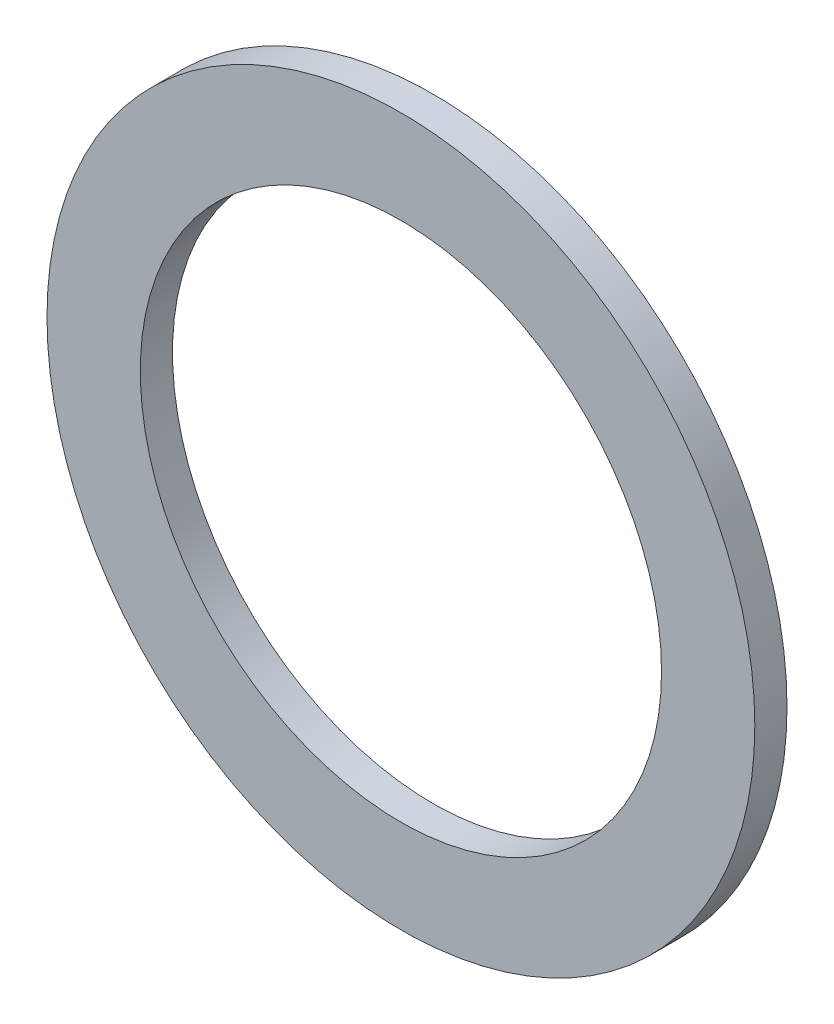
ISO-10303-21;
HEADER;
FILE_DESCRIPTION(('STEP AP214'),'2;1');
FILE_NAME('part.step','',(''),(''),'','','');
FILE_SCHEMA(('AUTOMOTIVE_DESIGN { 1 0 10303 214 1 1 1 1 }'));
ENDSEC;
DATA;
#1=APPLICATION_CONTEXT('core data for automotive mechanical design processes');
#2=APPLICATION_PROTOCOL_DEFINITION('international standard','automotive_design',2000,#1);
#3=PRODUCT_CONTEXT('',#1,'mechanical');
#4=PRODUCT('Part','Part','',(#3));
#5=PRODUCT_RELATED_PRODUCT_CATEGORY('part','',(#4));
#6=PRODUCT_DEFINITION_FORMATION('','',#4);
#7=PRODUCT_DEFINITION_CONTEXT('part definition',#1,'design');
#8=PRODUCT_DEFINITION('design','',#6,#7);
#9=PRODUCT_DEFINITION_SHAPE('','',#8);
#10=(LENGTH_UNIT() NAMED_UNIT(*) SI_UNIT(.MILLI.,.METRE.));
#11=(NAMED_UNIT(*) PLANE_ANGLE_UNIT() SI_UNIT($,.RADIAN.));
#12=(NAMED_UNIT(*) SI_UNIT($,.STERADIAN.) SOLID_ANGLE_UNIT());
#13=UNCERTAINTY_MEASURE_WITH_UNIT(LENGTH_MEASURE(1.E-05),#10,'distance_accuracy_value','');
#14=(GEOMETRIC_REPRESENTATION_CONTEXT(3) GLOBAL_UNCERTAINTY_ASSIGNED_CONTEXT((#13)) GLOBAL_UNIT_ASSIGNED_CONTEXT((#10,
#11,#12)) REPRESENTATION_CONTEXT('',''));
#15=CARTESIAN_POINT('',(0.,0.,0.));
#16=DIRECTION('',(0.,0.,1.));
#17=DIRECTION('',(1.,0.,0.));
#18=AXIS2_PLACEMENT_3D('',#15,#16,#17);
#19=CARTESIAN_POINT('',(0.,0.,-1.));
#20=DIRECTION('',(0.,0.,-1.));
#21=DIRECTION('',(1.,0.,0.));
#22=AXIS2_PLACEMENT_3D('',#19,#20,#21);
#23=PLANE('',#22);
#24=CARTESIAN_POINT('',(0.,0.,-1.));
#25=DIRECTION('',(0.,0.,1.));
#26=DIRECTION('',(1.,0.,0.));
#27=AXIS2_PLACEMENT_3D('',#24,#25,#26);
#28=CIRCLE('',#27,11.);
#29=CARTESIAN_POINT('',(11.,0.,-1.));
#30=VERTEX_POINT('',#29);
#31=EDGE_CURVE('E10',#30,#30,#28,.T.);
#32=ORIENTED_EDGE('',*,*,#31,.F.);
#33=EDGE_LOOP('',(#32));
#34=FACE_BOUND('',#33,.T.);
#35=CARTESIAN_POINT('',(0.,0.,-1.));
#36=DIRECTION('',(0.,0.,1.));
#37=DIRECTION('',(1.,0.,0.));
#38=AXIS2_PLACEMENT_3D('',#35,#36,#37);
#39=CIRCLE('',#38,8.1);
#40=CARTESIAN_POINT('',(8.1,0.,-1.));
#41=VERTEX_POINT('',#40);
#42=EDGE_CURVE('E56',#41,#41,#39,.T.);
#43=ORIENTED_EDGE('',*,*,#42,.T.);
#44=EDGE_LOOP('',(#43));
#45=FACE_BOUND('',#44,.T.);
#46=ADVANCED_FACE('F43',(#34,#45),#23,.T.);
#47=CARTESIAN_POINT('',(0.,0.,0.));
#48=DIRECTION('',(0.,0.,-1.));
#49=DIRECTION('',(1.,0.,0.));
#50=AXIS2_PLACEMENT_3D('',#47,#48,#49);
#51=PLANE('',#50);
#52=CARTESIAN_POINT('',(0.,0.,0.));
#53=DIRECTION('',(0.,0.,1.));
#54=DIRECTION('',(1.,0.,0.));
#55=AXIS2_PLACEMENT_3D('',#52,#53,#54);
#56=CIRCLE('',#55,11.);
#57=CARTESIAN_POINT('',(11.,0.,0.));
#58=VERTEX_POINT('',#57);
#59=EDGE_CURVE('E47',#58,#58,#56,.T.);
#60=ORIENTED_EDGE('',*,*,#59,.T.);
#61=EDGE_LOOP('',(#60));
#62=FACE_BOUND('',#61,.T.);
#63=CARTESIAN_POINT('',(0.,0.,0.));
#64=DIRECTION('',(0.,0.,1.));
#65=DIRECTION('',(1.,0.,0.));
#66=AXIS2_PLACEMENT_3D('',#63,#64,#65);
#67=CIRCLE('',#66,8.1);
#68=CARTESIAN_POINT('',(8.1,0.,0.));
#69=VERTEX_POINT('',#68);
#70=EDGE_CURVE('E58',#69,#69,#67,.T.);
#71=ORIENTED_EDGE('',*,*,#70,.F.);
#72=EDGE_LOOP('',(#71));
#73=FACE_BOUND('',#72,.T.);
#74=ADVANCED_FACE('F73',(#62,#73),#51,.F.);
#75=CARTESIAN_POINT('',(0.,0.,-1.));
#76=DIRECTION('',(0.,0.,1.));
#77=DIRECTION('',(-1.,0.,0.));
#78=AXIS2_PLACEMENT_3D('',#75,#76,#77);
#79=CYLINDRICAL_SURFACE('',#78,11.);
#80=ORIENTED_EDGE('',*,*,#31,.T.);
#81=EDGE_LOOP('',(#80));
#82=FACE_BOUND('',#81,.T.);
#83=ORIENTED_EDGE('',*,*,#59,.F.);
#84=EDGE_LOOP('',(#83));
#85=FACE_BOUND('',#84,.T.);
#86=ADVANCED_FACE('F45',(#82,#85),#79,.T.);
#87=CARTESIAN_POINT('',(0.,0.,-1.));
#88=DIRECTION('',(0.,0.,1.));
#89=DIRECTION('',(-1.,0.,0.));
#90=AXIS2_PLACEMENT_3D('',#87,#88,#89);
#91=CYLINDRICAL_SURFACE('',#90,8.1);
#92=ORIENTED_EDGE('',*,*,#42,.F.);
#93=EDGE_LOOP('',(#92));
#94=FACE_BOUND('',#93,.T.);
#95=ORIENTED_EDGE('',*,*,#70,.T.);
#96=EDGE_LOOP('',(#95));
#97=FACE_BOUND('',#96,.T.);
#98=ADVANCED_FACE('F67',(#94,#97),#91,.F.);
#99=CLOSED_SHELL('',(#46,#74,#86,#98));
#100=MANIFOLD_SOLID_BREP('B2',#99);
#101=ADVANCED_BREP_SHAPE_REPRESENTATION('',(#18,#100),#14);
#102=SHAPE_DEFINITION_REPRESENTATION(#9,#101);
ENDSEC;
END-ISO-10303-21;
